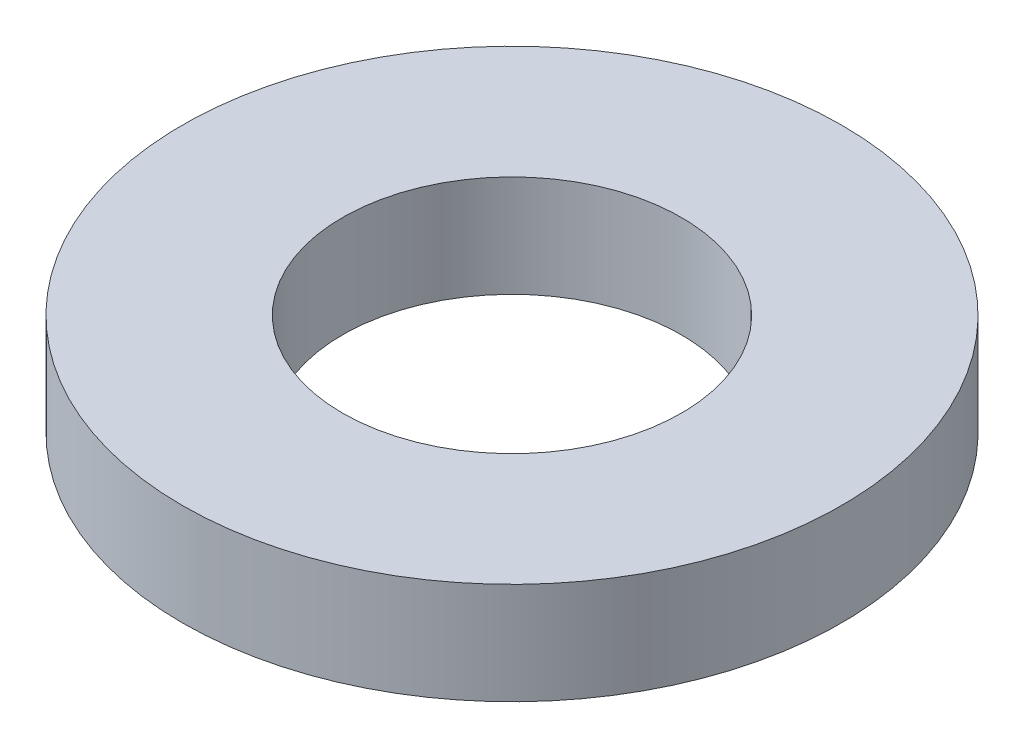
ISO-10303-21;
HEADER;
FILE_DESCRIPTION(('STEP AP214'),'2;1');
FILE_NAME('part.step','',(''),(''),'','','');
FILE_SCHEMA(('AUTOMOTIVE_DESIGN { 1 0 10303 214 1 1 1 1 }'));
ENDSEC;
DATA;
#1=APPLICATION_CONTEXT('core data for automotive mechanical design processes');
#2=APPLICATION_PROTOCOL_DEFINITION('international standard','automotive_design',2000,#1);
#3=PRODUCT_CONTEXT('',#1,'mechanical');
#4=PRODUCT('Part','Part','',(#3));
#5=PRODUCT_RELATED_PRODUCT_CATEGORY('part','',(#4));
#6=PRODUCT_DEFINITION_FORMATION('','',#4);
#7=PRODUCT_DEFINITION_CONTEXT('part definition',#1,'design');
#8=PRODUCT_DEFINITION('design','',#6,#7);
#9=PRODUCT_DEFINITION_SHAPE('','',#8);
#10=(LENGTH_UNIT() NAMED_UNIT(*) SI_UNIT(.MILLI.,.METRE.));
#11=(NAMED_UNIT(*) PLANE_ANGLE_UNIT() SI_UNIT($,.RADIAN.));
#12=(NAMED_UNIT(*) SI_UNIT($,.STERADIAN.) SOLID_ANGLE_UNIT());
#13=UNCERTAINTY_MEASURE_WITH_UNIT(LENGTH_MEASURE(1.E-05),#10,'distance_accuracy_value','');
#14=(GEOMETRIC_REPRESENTATION_CONTEXT(3) GLOBAL_UNCERTAINTY_ASSIGNED_CONTEXT((#13)) GLOBAL_UNIT_ASSIGNED_CONTEXT((#10,
#11,#12)) REPRESENTATION_CONTEXT('',''));
#15=CARTESIAN_POINT('',(0.,0.,0.));
#16=DIRECTION('',(0.,0.,1.));
#17=DIRECTION('',(1.,0.,0.));
#18=AXIS2_PLACEMENT_3D('',#15,#16,#17);
#19=CARTESIAN_POINT('',(0.,27.,0.));
#20=DIRECTION('',(0.,-1.,0.));
#21=DIRECTION('',(0.,0.,-1.));
#22=AXIS2_PLACEMENT_3D('',#19,#20,#21);
#23=CYLINDRICAL_SURFACE('',#22,87.5);
#24=CARTESIAN_POINT('',(0.,27.,0.));
#25=DIRECTION('',(0.,1.,0.));
#26=DIRECTION('',(0.,0.,1.));
#27=AXIS2_PLACEMENT_3D('',#24,#25,#26);
#28=CIRCLE('',#27,87.5);
#29=CARTESIAN_POINT('',(0.,27.,87.5));
#30=VERTEX_POINT('',#29);
#31=EDGE_CURVE('E10',#30,#30,#28,.T.);
#32=ORIENTED_EDGE('',*,*,#31,.F.);
#33=EDGE_LOOP('',(#32));
#34=FACE_BOUND('',#33,.T.);
#35=CARTESIAN_POINT('',(0.,0.,0.));
#36=DIRECTION('',(0.,1.,0.));
#37=DIRECTION('',(0.,0.,1.));
#38=AXIS2_PLACEMENT_3D('',#35,#36,#37);
#39=CIRCLE('',#38,87.5);
#40=CARTESIAN_POINT('',(0.,0.,87.5));
#41=VERTEX_POINT('',#40);
#42=EDGE_CURVE('E37',#41,#41,#39,.T.);
#43=ORIENTED_EDGE('',*,*,#42,.T.);
#44=EDGE_LOOP('',(#43));
#45=FACE_BOUND('',#44,.T.);
#46=ADVANCED_FACE('F40',(#34,#45),#23,.T.);
#47=CARTESIAN_POINT('',(0.,27.,0.));
#48=DIRECTION('',(0.,1.,0.));
#49=DIRECTION('',(0.,0.,1.));
#50=AXIS2_PLACEMENT_3D('',#47,#48,#49);
#51=PLANE('',#50);
#52=CARTESIAN_POINT('',(0.,27.,0.));
#53=DIRECTION('',(0.,1.,0.));
#54=DIRECTION('',(0.,0.,1.));
#55=AXIS2_PLACEMENT_3D('',#52,#53,#54);
#56=CIRCLE('',#55,45.);
#57=CARTESIAN_POINT('',(0.,27.,45.));
#58=VERTEX_POINT('',#57);
#59=EDGE_CURVE('E50',#58,#58,#56,.T.);
#60=ORIENTED_EDGE('',*,*,#59,.F.);
#61=EDGE_LOOP('',(#60));
#62=FACE_BOUND('',#61,.T.);
#63=ORIENTED_EDGE('',*,*,#31,.T.);
#64=EDGE_LOOP('',(#63));
#65=FACE_BOUND('',#64,.T.);
#66=ADVANCED_FACE('F59',(#62,#65),#51,.T.);
#67=CARTESIAN_POINT('',(0.,0.,0.));
#68=DIRECTION('',(0.,1.,0.));
#69=DIRECTION('',(0.,0.,1.));
#70=AXIS2_PLACEMENT_3D('',#67,#68,#69);
#71=PLANE('',#70);
#72=CARTESIAN_POINT('',(0.,0.,0.));
#73=DIRECTION('',(0.,1.,0.));
#74=DIRECTION('',(0.,0.,1.));
#75=AXIS2_PLACEMENT_3D('',#72,#73,#74);
#76=CIRCLE('',#75,45.);
#77=CARTESIAN_POINT('',(0.,0.,45.));
#78=VERTEX_POINT('',#77);
#79=EDGE_CURVE('E47',#78,#78,#76,.T.);
#80=ORIENTED_EDGE('',*,*,#79,.T.);
#81=EDGE_LOOP('',(#80));
#82=FACE_BOUND('',#81,.T.);
#83=ORIENTED_EDGE('',*,*,#42,.F.);
#84=EDGE_LOOP('',(#83));
#85=FACE_BOUND('',#84,.T.);
#86=ADVANCED_FACE('F58',(#82,#85),#71,.F.);
#87=CARTESIAN_POINT('',(0.,27.,0.));
#88=DIRECTION('',(0.,-1.,0.));
#89=DIRECTION('',(0.,0.,-1.));
#90=AXIS2_PLACEMENT_3D('',#87,#88,#89);
#91=CYLINDRICAL_SURFACE('',#90,45.);
#92=ORIENTED_EDGE('',*,*,#59,.T.);
#93=EDGE_LOOP('',(#92));
#94=FACE_BOUND('',#93,.T.);
#95=ORIENTED_EDGE('',*,*,#79,.F.);
#96=EDGE_LOOP('',(#95));
#97=FACE_BOUND('',#96,.T.);
#98=ADVANCED_FACE('F54',(#94,#97),#91,.F.);
#99=CLOSED_SHELL('',(#46,#66,#86,#98));
#100=MANIFOLD_SOLID_BREP('B2',#99);
#101=ADVANCED_BREP_SHAPE_REPRESENTATION('',(#18,#100),#14);
#102=SHAPE_DEFINITION_REPRESENTATION(#9,#101);
ENDSEC;
END-ISO-10303-21;
